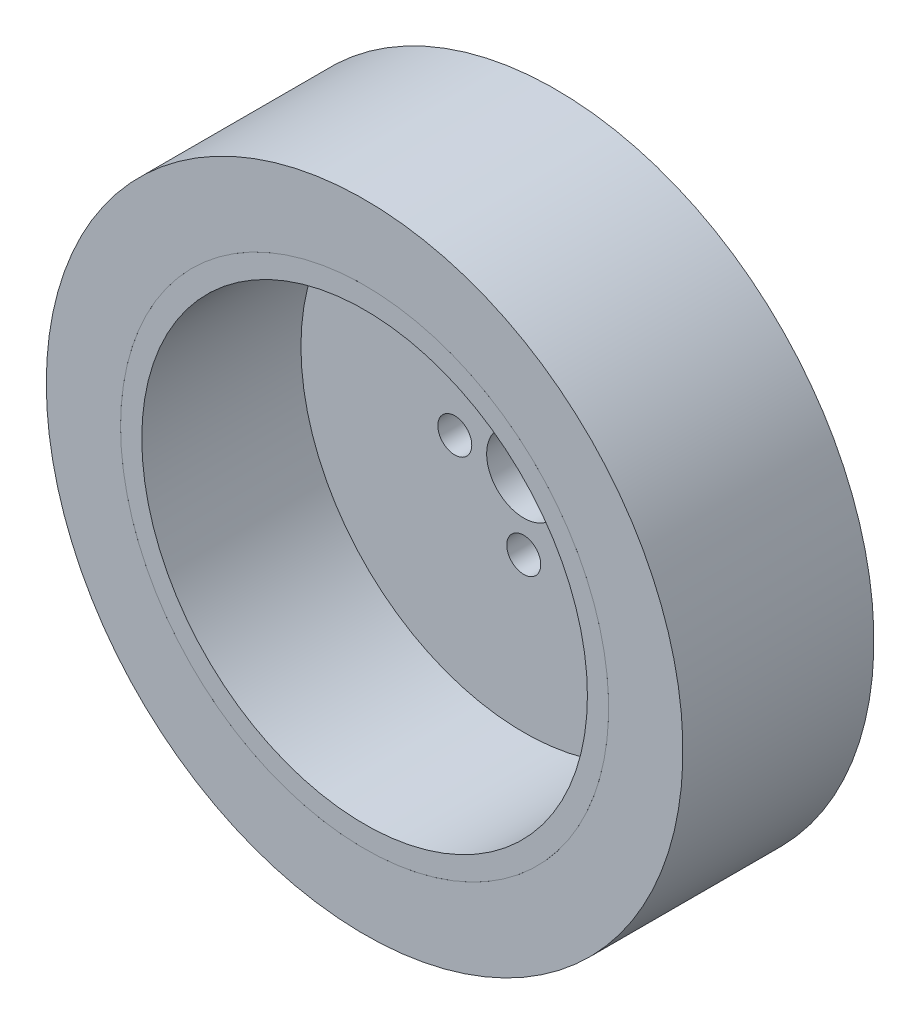
ISO-10303-21;
HEADER;
FILE_DESCRIPTION(('STEP AP214'),'2;1');
FILE_NAME('part.step','',(''),(''),'','','');
FILE_SCHEMA(('AUTOMOTIVE_DESIGN { 1 0 10303 214 1 1 1 1 }'));
ENDSEC;
DATA;
#1=APPLICATION_CONTEXT('core data for automotive mechanical design processes');
#2=APPLICATION_PROTOCOL_DEFINITION('international standard','automotive_design',2000,#1);
#3=PRODUCT_CONTEXT('',#1,'mechanical');
#4=PRODUCT('Part','Part','',(#3));
#5=PRODUCT_RELATED_PRODUCT_CATEGORY('part','',(#4));
#6=PRODUCT_DEFINITION_FORMATION('','',#4);
#7=PRODUCT_DEFINITION_CONTEXT('part definition',#1,'design');
#8=PRODUCT_DEFINITION('design','',#6,#7);
#9=PRODUCT_DEFINITION_SHAPE('','',#8);
#10=(LENGTH_UNIT() NAMED_UNIT(*) SI_UNIT(.MILLI.,.METRE.));
#11=(NAMED_UNIT(*) PLANE_ANGLE_UNIT() SI_UNIT($,.RADIAN.));
#12=(NAMED_UNIT(*) SI_UNIT($,.STERADIAN.) SOLID_ANGLE_UNIT());
#13=UNCERTAINTY_MEASURE_WITH_UNIT(LENGTH_MEASURE(1.E-05),#10,'distance_accuracy_value','');
#14=(GEOMETRIC_REPRESENTATION_CONTEXT(3) GLOBAL_UNCERTAINTY_ASSIGNED_CONTEXT((#13)) GLOBAL_UNIT_ASSIGNED_CONTEXT((#10,
#11,#12)) REPRESENTATION_CONTEXT('',''));
#15=CARTESIAN_POINT('',(0.,0.,0.));
#16=DIRECTION('',(0.,0.,1.));
#17=DIRECTION('',(1.,0.,0.));
#18=AXIS2_PLACEMENT_3D('',#15,#16,#17);
#19=CARTESIAN_POINT('',(-30.,0.,0.));
#20=DIRECTION('',(0.,0.,-1.));
#21=DIRECTION('',(-1.,0.,0.));
#22=AXIS2_PLACEMENT_3D('',#19,#20,#21);
#23=PLANE('',#22);
#24=CARTESIAN_POINT('',(0.,0.,-1.16874177715068E-13));
#25=DIRECTION('',(0.,0.,-1.));
#26=DIRECTION('',(-1.,0.,0.));
#27=AXIS2_PLACEMENT_3D('',#24,#25,#26);
#28=CIRCLE('',#27,29.9999999999999);
#29=CARTESIAN_POINT('',(-30.,0.,0.));
#30=VERTEX_POINT('',#29);
#31=EDGE_CURVE('E54',#30,#30,#28,.T.);
#32=ORIENTED_EDGE('',*,*,#31,.T.);
#33=EDGE_LOOP('',(#32));
#34=FACE_BOUND('',#33,.T.);
#35=CARTESIAN_POINT('',(0.,0.,0.));
#36=DIRECTION('',(0.,0.,-1.));
#37=DIRECTION('',(-1.,0.,0.));
#38=AXIS2_PLACEMENT_3D('',#35,#36,#37);
#39=CIRCLE('',#38,23.0009999999999);
#40=CARTESIAN_POINT('',(-23.001,0.,0.));
#41=VERTEX_POINT('',#40);
#42=EDGE_CURVE('E11',#41,#41,#39,.T.);
#43=ORIENTED_EDGE('',*,*,#42,.F.);
#44=EDGE_LOOP('',(#43));
#45=FACE_BOUND('',#44,.T.);
#46=ADVANCED_FACE('F40',(#34,#45),#23,.T.);
#47=CARTESIAN_POINT('',(0.,0.,0.));
#48=DIRECTION('',(0.,0.,-1.));
#49=DIRECTION('',(-1.,0.,0.));
#50=AXIS2_PLACEMENT_3D('',#47,#48,#49);
#51=CYLINDRICAL_SURFACE('',#50,23.001);
#52=ORIENTED_EDGE('',*,*,#42,.T.);
#53=EDGE_LOOP('',(#52));
#54=FACE_BOUND('',#53,.T.);
#55=CARTESIAN_POINT('',(0.,0.,17.9999999999999));
#56=DIRECTION('',(0.,0.,-1.));
#57=DIRECTION('',(-1.,0.,0.));
#58=AXIS2_PLACEMENT_3D('',#55,#56,#57);
#59=CIRCLE('',#58,23.001);
#60=CARTESIAN_POINT('',(-23.001,0.,18.));
#61=VERTEX_POINT('',#60);
#62=EDGE_CURVE('E46',#61,#61,#59,.T.);
#63=ORIENTED_EDGE('',*,*,#62,.F.);
#64=EDGE_LOOP('',(#63));
#65=FACE_BOUND('',#64,.T.);
#66=ADVANCED_FACE('F70',(#54,#65),#51,.F.);
#67=CARTESIAN_POINT('',(-23.001,0.,18.));
#68=DIRECTION('',(0.,0.,1.));
#69=DIRECTION('',(1.,0.,0.));
#70=AXIS2_PLACEMENT_3D('',#67,#68,#69);
#71=PLANE('',#70);
#72=ORIENTED_EDGE('',*,*,#62,.T.);
#73=EDGE_LOOP('',(#72));
#74=FACE_BOUND('',#73,.T.);
#75=CARTESIAN_POINT('',(0.,0.,17.9999999999999));
#76=DIRECTION('',(0.,0.,-1.));
#77=DIRECTION('',(-1.,0.,0.));
#78=AXIS2_PLACEMENT_3D('',#75,#76,#77);
#79=CIRCLE('',#78,30.);
#80=CARTESIAN_POINT('',(-30.,0.,18.));
#81=VERTEX_POINT('',#80);
#82=EDGE_CURVE('E50',#81,#81,#79,.T.);
#83=ORIENTED_EDGE('',*,*,#82,.F.);
#84=EDGE_LOOP('',(#83));
#85=FACE_BOUND('',#84,.T.);
#86=ADVANCED_FACE('F64',(#74,#85),#71,.T.);
#87=CARTESIAN_POINT('',(0.,0.,0.));
#88=DIRECTION('',(0.,0.,-1.));
#89=DIRECTION('',(-1.,0.,0.));
#90=AXIS2_PLACEMENT_3D('',#87,#88,#89);
#91=CYLINDRICAL_SURFACE('',#90,30.);
#92=ORIENTED_EDGE('',*,*,#82,.T.);
#93=EDGE_LOOP('',(#92));
#94=FACE_BOUND('',#93,.T.);
#95=ORIENTED_EDGE('',*,*,#31,.F.);
#96=EDGE_LOOP('',(#95));
#97=FACE_BOUND('',#96,.T.);
#98=ADVANCED_FACE('F62',(#94,#97),#91,.T.);
#99=CLOSED_SHELL('',(#46,#66,#86,#98));
#100=MANIFOLD_SOLID_BREP('B2',#99);
#101=CARTESIAN_POINT('',(0.,0.,0.));
#102=DIRECTION('',(0.,0.,-1.));
#103=DIRECTION('',(-1.,0.,0.));
#104=AXIS2_PLACEMENT_3D('',#101,#102,#103);
#105=CYLINDRICAL_SURFACE('',#104,3.5);
#106=CARTESIAN_POINT('',(0.,0.,0.));
#107=DIRECTION('',(0.,0.,-1.));
#108=DIRECTION('',(-1.,0.,0.));
#109=AXIS2_PLACEMENT_3D('',#106,#107,#108);
#110=CIRCLE('',#109,3.5);
#111=CARTESIAN_POINT('',(-3.5,0.,0.));
#112=VERTEX_POINT('',#111);
#113=EDGE_CURVE('E39',#112,#112,#110,.T.);
#114=ORIENTED_EDGE('',*,*,#113,.T.);
#115=EDGE_LOOP('',(#114));
#116=FACE_BOUND('',#115,.T.);
#117=CARTESIAN_POINT('',(0.,0.,3.));
#118=DIRECTION('',(0.,0.,-1.));
#119=DIRECTION('',(-1.,0.,0.));
#120=AXIS2_PLACEMENT_3D('',#117,#118,#119);
#121=CIRCLE('',#120,3.5);
#122=CARTESIAN_POINT('',(-3.5,0.,3.));
#123=VERTEX_POINT('',#122);
#124=EDGE_CURVE('E128',#123,#123,#121,.T.);
#125=ORIENTED_EDGE('',*,*,#124,.F.);
#126=EDGE_LOOP('',(#125));
#127=FACE_BOUND('',#126,.T.);
#128=ADVANCED_FACE('F101',(#116,#127),#105,.F.);
#129=CARTESIAN_POINT('',(-3.5,0.,0.));
#130=DIRECTION('',(0.,0.,-1.));
#131=DIRECTION('',(-1.,0.,0.));
#132=AXIS2_PLACEMENT_3D('',#129,#130,#131);
#133=PLANE('',#132);
#134=CARTESIAN_POINT('',(-6.5,0.,0.));
#135=DIRECTION('',(0.,0.,-1.));
#136=DIRECTION('',(-1.,0.,0.));
#137=AXIS2_PLACEMENT_3D('',#134,#135,#136);
#138=CIRCLE('',#137,1.6);
#139=CARTESIAN_POINT('',(-8.1,0.,0.));
#140=VERTEX_POINT('',#139);
#141=EDGE_CURVE('E121',#140,#140,#138,.T.);
#142=ORIENTED_EDGE('',*,*,#141,.F.);
#143=EDGE_LOOP('',(#142));
#144=FACE_BOUND('',#143,.T.);
#145=CARTESIAN_POINT('',(0.,-6.5,0.));
#146=DIRECTION('',(0.,0.,-1.));
#147=DIRECTION('',(-1.,0.,0.));
#148=AXIS2_PLACEMENT_3D('',#145,#146,#147);
#149=CIRCLE('',#148,1.6);
#150=CARTESIAN_POINT('',(-1.59999999999998,-6.5,0.));
#151=VERTEX_POINT('',#150);
#152=EDGE_CURVE('E178',#151,#151,#149,.T.);
#153=ORIENTED_EDGE('',*,*,#152,.F.);
#154=EDGE_LOOP('',(#153));
#155=FACE_BOUND('',#154,.T.);
#156=CARTESIAN_POINT('',(6.5,0.,0.));
#157=DIRECTION('',(0.,0.,-1.));
#158=DIRECTION('',(-1.,0.,0.));
#159=AXIS2_PLACEMENT_3D('',#156,#157,#158);
#160=CIRCLE('',#159,1.6);
#161=CARTESIAN_POINT('',(4.9,0.,0.));
#162=VERTEX_POINT('',#161);
#163=EDGE_CURVE('E182',#162,#162,#160,.T.);
#164=ORIENTED_EDGE('',*,*,#163,.F.);
#165=EDGE_LOOP('',(#164));
#166=FACE_BOUND('',#165,.T.);
#167=CARTESIAN_POINT('',(0.,6.5,0.));
#168=DIRECTION('',(0.,0.,-1.));
#169=DIRECTION('',(-1.,0.,0.));
#170=AXIS2_PLACEMENT_3D('',#167,#168,#169);
#171=CIRCLE('',#170,1.6);
#172=CARTESIAN_POINT('',(-1.60000000000007,6.5,0.));
#173=VERTEX_POINT('',#172);
#174=EDGE_CURVE('E140',#173,#173,#171,.T.);
#175=ORIENTED_EDGE('',*,*,#174,.F.);
#176=EDGE_LOOP('',(#175));
#177=FACE_BOUND('',#176,.T.);
#178=CARTESIAN_POINT('',(0.,0.,0.));
#179=DIRECTION('',(0.,0.,-1.));
#180=DIRECTION('',(-1.,0.,0.));
#181=AXIS2_PLACEMENT_3D('',#178,#179,#180);
#182=CIRCLE('',#181,23.);
#183=CARTESIAN_POINT('',(-23.,0.,0.));
#184=VERTEX_POINT('',#183);
#185=EDGE_CURVE('E108',#184,#184,#182,.T.);
#186=ORIENTED_EDGE('',*,*,#185,.T.);
#187=EDGE_LOOP('',(#186));
#188=FACE_BOUND('',#187,.T.);
#189=ORIENTED_EDGE('',*,*,#113,.F.);
#190=EDGE_LOOP('',(#189));
#191=FACE_BOUND('',#190,.T.);
#192=ADVANCED_FACE('F162',(#144,#155,#166,#177,#188,#191),#133,.T.);
#193=CARTESIAN_POINT('',(0.,0.,0.));
#194=DIRECTION('',(0.,0.,-1.));
#195=DIRECTION('',(-1.,0.,0.));
#196=AXIS2_PLACEMENT_3D('',#193,#194,#195);
#197=CYLINDRICAL_SURFACE('',#196,23.);
#198=CARTESIAN_POINT('',(0.,0.,18.));
#199=DIRECTION('',(0.,0.,-1.));
#200=DIRECTION('',(-1.,0.,0.));
#201=AXIS2_PLACEMENT_3D('',#198,#199,#200);
#202=CIRCLE('',#201,23.);
#203=CARTESIAN_POINT('',(-23.,0.,18.));
#204=VERTEX_POINT('',#203);
#205=EDGE_CURVE('E113',#204,#204,#202,.T.);
#206=ORIENTED_EDGE('',*,*,#205,.T.);
#207=EDGE_LOOP('',(#206));
#208=FACE_BOUND('',#207,.T.);
#209=ORIENTED_EDGE('',*,*,#185,.F.);
#210=EDGE_LOOP('',(#209));
#211=FACE_BOUND('',#210,.T.);
#212=ADVANCED_FACE('F147',(#208,#211),#197,.T.);
#213=CARTESIAN_POINT('',(-23.,0.,18.));
#214=DIRECTION('',(0.,0.,1.));
#215=DIRECTION('',(1.,0.,0.));
#216=AXIS2_PLACEMENT_3D('',#213,#214,#215);
#217=PLANE('',#216);
#218=CARTESIAN_POINT('',(0.,0.,18.));
#219=DIRECTION('',(0.,0.,-1.));
#220=DIRECTION('',(-1.,0.,0.));
#221=AXIS2_PLACEMENT_3D('',#218,#219,#220);
#222=CIRCLE('',#221,21.);
#223=CARTESIAN_POINT('',(-21.,0.,18.));
#224=VERTEX_POINT('',#223);
#225=EDGE_CURVE('E137',#224,#224,#222,.T.);
#226=ORIENTED_EDGE('',*,*,#225,.T.);
#227=EDGE_LOOP('',(#226));
#228=FACE_BOUND('',#227,.T.);
#229=ORIENTED_EDGE('',*,*,#205,.F.);
#230=EDGE_LOOP('',(#229));
#231=FACE_BOUND('',#230,.T.);
#232=ADVANCED_FACE('F150',(#228,#231),#217,.T.);
#233=CARTESIAN_POINT('',(0.,0.,0.));
#234=DIRECTION('',(0.,0.,-1.));
#235=DIRECTION('',(-1.,0.,0.));
#236=AXIS2_PLACEMENT_3D('',#233,#234,#235);
#237=CYLINDRICAL_SURFACE('',#236,21.);
#238=CARTESIAN_POINT('',(0.,0.,3.));
#239=DIRECTION('',(0.,0.,-1.));
#240=DIRECTION('',(-1.,0.,0.));
#241=AXIS2_PLACEMENT_3D('',#238,#239,#240);
#242=CIRCLE('',#241,21.);
#243=CARTESIAN_POINT('',(-21.,0.,3.));
#244=VERTEX_POINT('',#243);
#245=EDGE_CURVE('E132',#244,#244,#242,.T.);
#246=ORIENTED_EDGE('',*,*,#245,.T.);
#247=EDGE_LOOP('',(#246));
#248=FACE_BOUND('',#247,.T.);
#249=ORIENTED_EDGE('',*,*,#225,.F.);
#250=EDGE_LOOP('',(#249));
#251=FACE_BOUND('',#250,.T.);
#252=ADVANCED_FACE('F152',(#248,#251),#237,.F.);
#253=CARTESIAN_POINT('',(-21.,0.,3.));
#254=DIRECTION('',(0.,0.,1.));
#255=DIRECTION('',(1.,0.,0.));
#256=AXIS2_PLACEMENT_3D('',#253,#254,#255);
#257=PLANE('',#256);
#258=CARTESIAN_POINT('',(-6.5,0.,3.));
#259=DIRECTION('',(0.,0.,1.));
#260=DIRECTION('',(1.,0.,0.));
#261=AXIS2_PLACEMENT_3D('',#258,#259,#260);
#262=CIRCLE('',#261,1.6);
#263=CARTESIAN_POINT('',(-4.9,0.,3.));
#264=VERTEX_POINT('',#263);
#265=EDGE_CURVE('E104',#264,#264,#262,.T.);
#266=ORIENTED_EDGE('',*,*,#265,.F.);
#267=EDGE_LOOP('',(#266));
#268=FACE_BOUND('',#267,.T.);
#269=CARTESIAN_POINT('',(0.,-6.5,3.));
#270=DIRECTION('',(0.,0.,1.));
#271=DIRECTION('',(1.,0.,0.));
#272=AXIS2_PLACEMENT_3D('',#269,#270,#271);
#273=CIRCLE('',#272,1.6);
#274=CARTESIAN_POINT('',(1.60000000000002,-6.5,3.));
#275=VERTEX_POINT('',#274);
#276=EDGE_CURVE('E123',#275,#275,#273,.T.);
#277=ORIENTED_EDGE('',*,*,#276,.F.);
#278=EDGE_LOOP('',(#277));
#279=FACE_BOUND('',#278,.T.);
#280=CARTESIAN_POINT('',(6.5,0.,3.));
#281=DIRECTION('',(0.,0.,1.));
#282=DIRECTION('',(1.,0.,0.));
#283=AXIS2_PLACEMENT_3D('',#280,#281,#282);
#284=CIRCLE('',#283,1.6);
#285=CARTESIAN_POINT('',(8.1,0.,3.));
#286=VERTEX_POINT('',#285);
#287=EDGE_CURVE('E120',#286,#286,#284,.T.);
#288=ORIENTED_EDGE('',*,*,#287,.F.);
#289=EDGE_LOOP('',(#288));
#290=FACE_BOUND('',#289,.T.);
#291=CARTESIAN_POINT('',(0.,6.5,3.));
#292=DIRECTION('',(0.,0.,1.));
#293=DIRECTION('',(1.,0.,0.));
#294=AXIS2_PLACEMENT_3D('',#291,#292,#293);
#295=CIRCLE('',#294,1.6);
#296=CARTESIAN_POINT('',(1.59999999999993,6.5,3.));
#297=VERTEX_POINT('',#296);
#298=EDGE_CURVE('E117',#297,#297,#295,.T.);
#299=ORIENTED_EDGE('',*,*,#298,.F.);
#300=EDGE_LOOP('',(#299));
#301=FACE_BOUND('',#300,.T.);
#302=ORIENTED_EDGE('',*,*,#124,.T.);
#303=EDGE_LOOP('',(#302));
#304=FACE_BOUND('',#303,.T.);
#305=ORIENTED_EDGE('',*,*,#245,.F.);
#306=EDGE_LOOP('',(#305));
#307=FACE_BOUND('',#306,.T.);
#308=ADVANCED_FACE('F159',(#268,#279,#290,#301,#304,#307),#257,.T.);
#309=CARTESIAN_POINT('',(0.,6.5,10.));
#310=DIRECTION('',(0.,0.,-1.));
#311=DIRECTION('',(-1.,0.,0.));
#312=AXIS2_PLACEMENT_3D('',#309,#310,#311);
#313=CYLINDRICAL_SURFACE('',#312,1.6);
#314=ORIENTED_EDGE('',*,*,#298,.T.);
#315=EDGE_LOOP('',(#314));
#316=FACE_BOUND('',#315,.T.);
#317=ORIENTED_EDGE('',*,*,#174,.T.);
#318=EDGE_LOOP('',(#317));
#319=FACE_BOUND('',#318,.T.);
#320=ADVANCED_FACE('F205',(#316,#319),#313,.F.);
#321=CARTESIAN_POINT('',(6.5,0.,10.));
#322=DIRECTION('',(0.,0.,-1.));
#323=DIRECTION('',(-1.,0.,0.));
#324=AXIS2_PLACEMENT_3D('',#321,#322,#323);
#325=CYLINDRICAL_SURFACE('',#324,1.6);
#326=ORIENTED_EDGE('',*,*,#287,.T.);
#327=EDGE_LOOP('',(#326));
#328=FACE_BOUND('',#327,.T.);
#329=ORIENTED_EDGE('',*,*,#163,.T.);
#330=EDGE_LOOP('',(#329));
#331=FACE_BOUND('',#330,.T.);
#332=ADVANCED_FACE('F200',(#328,#331),#325,.F.);
#333=CARTESIAN_POINT('',(0.,-6.5,10.));
#334=DIRECTION('',(0.,0.,-1.));
#335=DIRECTION('',(-1.,0.,0.));
#336=AXIS2_PLACEMENT_3D('',#333,#334,#335);
#337=CYLINDRICAL_SURFACE('',#336,1.6);
#338=ORIENTED_EDGE('',*,*,#276,.T.);
#339=EDGE_LOOP('',(#338));
#340=FACE_BOUND('',#339,.T.);
#341=ORIENTED_EDGE('',*,*,#152,.T.);
#342=EDGE_LOOP('',(#341));
#343=FACE_BOUND('',#342,.T.);
#344=ADVANCED_FACE('F195',(#340,#343),#337,.F.);
#345=CARTESIAN_POINT('',(-6.5,0.,10.));
#346=DIRECTION('',(0.,0.,-1.));
#347=DIRECTION('',(-1.,0.,0.));
#348=AXIS2_PLACEMENT_3D('',#345,#346,#347);
#349=CYLINDRICAL_SURFACE('',#348,1.6);
#350=ORIENTED_EDGE('',*,*,#265,.T.);
#351=EDGE_LOOP('',(#350));
#352=FACE_BOUND('',#351,.T.);
#353=ORIENTED_EDGE('',*,*,#141,.T.);
#354=EDGE_LOOP('',(#353));
#355=FACE_BOUND('',#354,.T.);
#356=ADVANCED_FACE('F193',(#352,#355),#349,.F.);
#357=CLOSED_SHELL('',(#128,#192,#212,#232,#252,#308,#320,#332,#344,#356));
#358=MANIFOLD_SOLID_BREP('B6',#357);
#359=ADVANCED_BREP_SHAPE_REPRESENTATION('',(#18,#100,#358),#14);
#360=SHAPE_DEFINITION_REPRESENTATION(#9,#359);
ENDSEC;
END-ISO-10303-21;
